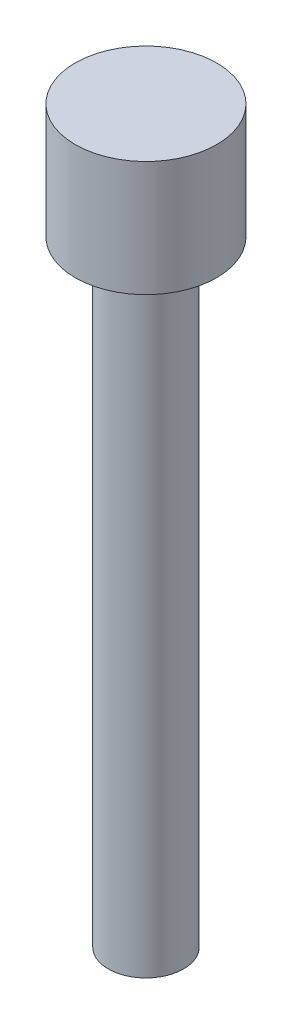
ISO-10303-21;
HEADER;
FILE_DESCRIPTION(('STEP AP214'),'2;1');
FILE_NAME('part.step','',(''),(''),'','','');
FILE_SCHEMA(('AUTOMOTIVE_DESIGN { 1 0 10303 214 1 1 1 1 }'));
ENDSEC;
DATA;
#1=APPLICATION_CONTEXT('core data for automotive mechanical design processes');
#2=APPLICATION_PROTOCOL_DEFINITION('international standard','automotive_design',2000,#1);
#3=PRODUCT_CONTEXT('',#1,'mechanical');
#4=PRODUCT('Part','Part','',(#3));
#5=PRODUCT_RELATED_PRODUCT_CATEGORY('part','',(#4));
#6=PRODUCT_DEFINITION_FORMATION('','',#4);
#7=PRODUCT_DEFINITION_CONTEXT('part definition',#1,'design');
#8=PRODUCT_DEFINITION('design','',#6,#7);
#9=PRODUCT_DEFINITION_SHAPE('','',#8);
#10=(LENGTH_UNIT() NAMED_UNIT(*) SI_UNIT(.MILLI.,.METRE.));
#11=(NAMED_UNIT(*) PLANE_ANGLE_UNIT() SI_UNIT($,.RADIAN.));
#12=(NAMED_UNIT(*) SI_UNIT($,.STERADIAN.) SOLID_ANGLE_UNIT());
#13=UNCERTAINTY_MEASURE_WITH_UNIT(LENGTH_MEASURE(1.E-05),#10,'distance_accuracy_value','');
#14=(GEOMETRIC_REPRESENTATION_CONTEXT(3) GLOBAL_UNCERTAINTY_ASSIGNED_CONTEXT((#13)) GLOBAL_UNIT_ASSIGNED_CONTEXT((#10,
#11,#12)) REPRESENTATION_CONTEXT('',''));
#15=CARTESIAN_POINT('',(0.,0.,0.));
#16=DIRECTION('',(0.,0.,1.));
#17=DIRECTION('',(1.,0.,0.));
#18=AXIS2_PLACEMENT_3D('',#15,#16,#17);
#19=CARTESIAN_POINT('',(0.,3.,0.));
#20=DIRECTION('',(0.,-1.,0.));
#21=DIRECTION('',(0.,0.,-1.));
#22=AXIS2_PLACEMENT_3D('',#19,#20,#21);
#23=CYLINDRICAL_SURFACE('',#22,1.84);
#24=CARTESIAN_POINT('',(0.,3.,0.));
#25=DIRECTION('',(0.,1.,0.));
#26=DIRECTION('',(0.,0.,1.));
#27=AXIS2_PLACEMENT_3D('',#24,#25,#26);
#28=CIRCLE('',#27,1.84);
#29=CARTESIAN_POINT('',(0.,3.,1.84));
#30=VERTEX_POINT('',#29);
#31=EDGE_CURVE('E45',#30,#30,#28,.T.);
#32=ORIENTED_EDGE('',*,*,#31,.F.);
#33=EDGE_LOOP('',(#32));
#34=FACE_BOUND('',#33,.T.);
#35=CARTESIAN_POINT('',(0.,0.,0.));
#36=DIRECTION('',(0.,1.,0.));
#37=DIRECTION('',(0.,0.,1.));
#38=AXIS2_PLACEMENT_3D('',#35,#36,#37);
#39=CIRCLE('',#38,1.84);
#40=CARTESIAN_POINT('',(0.,0.,1.84));
#41=VERTEX_POINT('',#40);
#42=EDGE_CURVE('E40',#41,#41,#39,.T.);
#43=ORIENTED_EDGE('',*,*,#42,.T.);
#44=EDGE_LOOP('',(#43));
#45=FACE_BOUND('',#44,.T.);
#46=ADVANCED_FACE('F37',(#34,#45),#23,.T.);
#47=CARTESIAN_POINT('',(0.,3.,0.));
#48=DIRECTION('',(0.,1.,0.));
#49=DIRECTION('',(0.,0.,1.));
#50=AXIS2_PLACEMENT_3D('',#47,#48,#49);
#51=PLANE('',#50);
#52=ORIENTED_EDGE('',*,*,#31,.T.);
#53=EDGE_LOOP('',(#52));
#54=FACE_BOUND('',#53,.T.);
#55=ADVANCED_FACE('F65',(#54),#51,.T.);
#56=CARTESIAN_POINT('',(0.,0.,0.));
#57=DIRECTION('',(0.,1.,0.));
#58=DIRECTION('',(0.,0.,1.));
#59=AXIS2_PLACEMENT_3D('',#56,#57,#58);
#60=PLANE('',#59);
#61=CARTESIAN_POINT('',(0.,0.,0.));
#62=DIRECTION('',(0.,-1.,0.));
#63=DIRECTION('',(0.,0.,-1.));
#64=AXIS2_PLACEMENT_3D('',#61,#62,#63);
#65=CIRCLE('',#64,0.98);
#66=CARTESIAN_POINT('',(0.,0.,-0.98));
#67=VERTEX_POINT('',#66);
#68=EDGE_CURVE('E10',#67,#67,#65,.T.);
#69=ORIENTED_EDGE('',*,*,#68,.F.);
#70=EDGE_LOOP('',(#69));
#71=FACE_BOUND('',#70,.T.);
#72=ORIENTED_EDGE('',*,*,#42,.F.);
#73=EDGE_LOOP('',(#72));
#74=FACE_BOUND('',#73,.T.);
#75=ADVANCED_FACE('F62',(#71,#74),#60,.F.);
#76=CARTESIAN_POINT('',(0.,-16.,0.));
#77=DIRECTION('',(0.,1.,0.));
#78=DIRECTION('',(0.,0.,1.));
#79=AXIS2_PLACEMENT_3D('',#76,#77,#78);
#80=CYLINDRICAL_SURFACE('',#79,0.98);
#81=CARTESIAN_POINT('',(0.,-16.,0.));
#82=DIRECTION('',(0.,-1.,0.));
#83=DIRECTION('',(0.,0.,-1.));
#84=AXIS2_PLACEMENT_3D('',#81,#82,#83);
#85=CIRCLE('',#84,0.98);
#86=CARTESIAN_POINT('',(0.,-16.,-0.98));
#87=VERTEX_POINT('',#86);
#88=EDGE_CURVE('E52',#87,#87,#85,.T.);
#89=ORIENTED_EDGE('',*,*,#88,.F.);
#90=EDGE_LOOP('',(#89));
#91=FACE_BOUND('',#90,.T.);
#92=ORIENTED_EDGE('',*,*,#68,.T.);
#93=EDGE_LOOP('',(#92));
#94=FACE_BOUND('',#93,.T.);
#95=ADVANCED_FACE('F64',(#91,#94),#80,.T.);
#96=CARTESIAN_POINT('',(0.,-16.,0.));
#97=DIRECTION('',(0.,-1.,0.));
#98=DIRECTION('',(0.,0.,-1.));
#99=AXIS2_PLACEMENT_3D('',#96,#97,#98);
#100=PLANE('',#99);
#101=ORIENTED_EDGE('',*,*,#88,.T.);
#102=EDGE_LOOP('',(#101));
#103=FACE_BOUND('',#102,.T.);
#104=ADVANCED_FACE('F71',(#103),#100,.T.);
#105=CLOSED_SHELL('',(#46,#55,#75,#95,#104));
#106=MANIFOLD_SOLID_BREP('B2',#105);
#107=ADVANCED_BREP_SHAPE_REPRESENTATION('',(#18,#106),#14);
#108=SHAPE_DEFINITION_REPRESENTATION(#9,#107);
ENDSEC;
END-ISO-10303-21;
